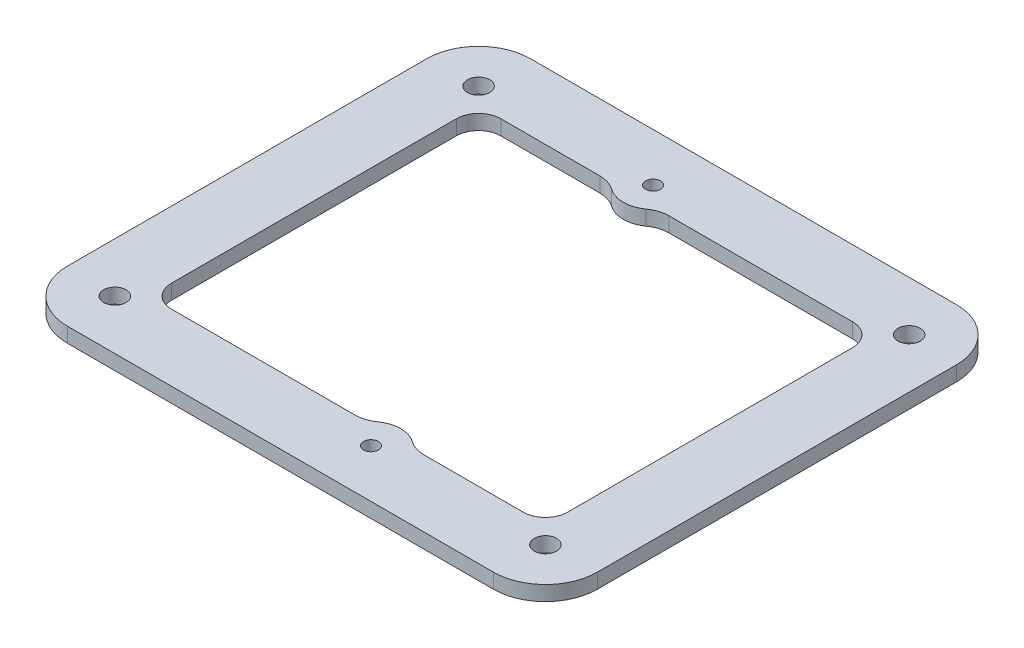
ISO-10303-21;
HEADER;
FILE_DESCRIPTION(('STEP AP214'),'2;1');
FILE_NAME('part.step','',(''),(''),'','','');
FILE_SCHEMA(('AUTOMOTIVE_DESIGN { 1 0 10303 214 1 1 1 1 }'));
ENDSEC;
DATA;
#1=APPLICATION_CONTEXT('core data for automotive mechanical design processes');
#2=APPLICATION_PROTOCOL_DEFINITION('international standard','automotive_design',2000,#1);
#3=PRODUCT_CONTEXT('',#1,'mechanical');
#4=PRODUCT('Part','Part','',(#3));
#5=PRODUCT_RELATED_PRODUCT_CATEGORY('part','',(#4));
#6=PRODUCT_DEFINITION_FORMATION('','',#4);
#7=PRODUCT_DEFINITION_CONTEXT('part definition',#1,'design');
#8=PRODUCT_DEFINITION('design','',#6,#7);
#9=PRODUCT_DEFINITION_SHAPE('','',#8);
#10=(LENGTH_UNIT() NAMED_UNIT(*) SI_UNIT(.MILLI.,.METRE.));
#11=(NAMED_UNIT(*) PLANE_ANGLE_UNIT() SI_UNIT($,.RADIAN.));
#12=(NAMED_UNIT(*) SI_UNIT($,.STERADIAN.) SOLID_ANGLE_UNIT());
#13=UNCERTAINTY_MEASURE_WITH_UNIT(LENGTH_MEASURE(1.E-05),#10,'distance_accuracy_value','');
#14=(GEOMETRIC_REPRESENTATION_CONTEXT(3) GLOBAL_UNCERTAINTY_ASSIGNED_CONTEXT((#13)) GLOBAL_UNIT_ASSIGNED_CONTEXT((#10,
#11,#12)) REPRESENTATION_CONTEXT('',''));
#15=CARTESIAN_POINT('',(0.,0.,0.));
#16=DIRECTION('',(0.,0.,1.));
#17=DIRECTION('',(1.,0.,0.));
#18=AXIS2_PLACEMENT_3D('',#15,#16,#17);
#19=CARTESIAN_POINT('',(0.,2.,0.));
#20=DIRECTION('',(0.,-1.,0.));
#21=DIRECTION('',(0.,0.,-1.));
#22=AXIS2_PLACEMENT_3D('',#19,#20,#21);
#23=PLANE('',#22);
#24=DIRECTION('',(0.,0.,-1.));
#25=VECTOR('',#24,1.);
#26=CARTESIAN_POINT('',(35.6966991411009,2.,19.1966991411009));
#27=LINE('',#26,#25);
#28=CARTESIAN_POINT('',(35.6966991411009,2.,24.1966991411009));
#29=VERTEX_POINT('',#28);
#30=CARTESIAN_POINT('',(35.6966991411009,2.,-24.1966991411009));
#31=VERTEX_POINT('',#30);
#32=EDGE_CURVE('E334',#29,#31,#27,.T.);
#33=ORIENTED_EDGE('',*,*,#32,.T.);
#34=CARTESIAN_POINT('',(28.6966991411009,2.,-24.1966991411009));
#35=DIRECTION('',(0.,-1.,0.));
#36=DIRECTION('',(0.,0.,-1.));
#37=AXIS2_PLACEMENT_3D('',#34,#35,#36);
#38=CIRCLE('',#37,7.00000000000001);
#39=CARTESIAN_POINT('',(28.6966991411009,2.,-31.1966991411008));
#40=VERTEX_POINT('',#39);
#41=EDGE_CURVE('E369',#31,#40,#38,.F.);
#42=ORIENTED_EDGE('',*,*,#41,.T.);
#43=DIRECTION('',(-1.,0.,0.));
#44=VECTOR('',#43,1.);
#45=CARTESIAN_POINT('',(-23.6966991411009,2.,-31.1966991411009));
#46=LINE('',#45,#44);
#47=CARTESIAN_POINT('',(-28.6966991411009,2.,-31.1966991411009));
#48=VERTEX_POINT('',#47);
#49=EDGE_CURVE('E326',#40,#48,#46,.T.);
#50=ORIENTED_EDGE('',*,*,#49,.T.);
#51=CARTESIAN_POINT('',(-28.6966991411009,2.,-24.1966991411009));
#52=DIRECTION('',(0.,-1.,0.));
#53=DIRECTION('',(0.,0.,-1.));
#54=AXIS2_PLACEMENT_3D('',#51,#52,#53);
#55=CIRCLE('',#54,7.00000000000001);
#56=CARTESIAN_POINT('',(-35.6966991411009,2.,-24.1966991411009));
#57=VERTEX_POINT('',#56);
#58=EDGE_CURVE('E367',#48,#57,#55,.F.);
#59=ORIENTED_EDGE('',*,*,#58,.T.);
#60=DIRECTION('',(0.,0.,1.));
#61=VECTOR('',#60,1.);
#62=CARTESIAN_POINT('',(-35.6966991411009,2.,-19.1966991411009));
#63=LINE('',#62,#61);
#64=CARTESIAN_POINT('',(-35.6966991411009,2.,24.1966991411009));
#65=VERTEX_POINT('',#64);
#66=EDGE_CURVE('E329',#57,#65,#63,.T.);
#67=ORIENTED_EDGE('',*,*,#66,.T.);
#68=CARTESIAN_POINT('',(-28.6966991411009,2.,24.1966991411009));
#69=DIRECTION('',(0.,-1.,0.));
#70=DIRECTION('',(0.,0.,-1.));
#71=AXIS2_PLACEMENT_3D('',#68,#69,#70);
#72=CIRCLE('',#71,7.00000000000001);
#73=CARTESIAN_POINT('',(-28.6966991411009,2.,31.1966991411009));
#74=VERTEX_POINT('',#73);
#75=EDGE_CURVE('E55',#65,#74,#72,.F.);
#76=ORIENTED_EDGE('',*,*,#75,.T.);
#77=DIRECTION('',(1.,0.,0.));
#78=VECTOR('',#77,1.);
#79=CARTESIAN_POINT('',(-23.6966991411009,2.,31.1966991411009));
#80=LINE('',#79,#78);
#81=CARTESIAN_POINT('',(28.6966991411009,2.,31.1966991411009));
#82=VERTEX_POINT('',#81);
#83=EDGE_CURVE('E332',#74,#82,#80,.T.);
#84=ORIENTED_EDGE('',*,*,#83,.T.);
#85=CARTESIAN_POINT('',(28.6966991411009,2.,24.1966991411009));
#86=DIRECTION('',(0.,-1.,0.));
#87=DIRECTION('',(0.,0.,-1.));
#88=AXIS2_PLACEMENT_3D('',#85,#86,#87);
#89=CIRCLE('',#88,7.00000000000001);
#90=EDGE_CURVE('E365',#82,#29,#89,.F.);
#91=ORIENTED_EDGE('',*,*,#90,.T.);
#92=EDGE_LOOP('',(#33,#42,#50,#59,#67,#76,#84,#91));
#93=FACE_BOUND('',#92,.T.);
#94=CARTESIAN_POINT('',(-10.3590840043945,2.,-18.1966991411009));
#95=DIRECTION('',(0.,1.,0.));
#96=DIRECTION('',(0.,0.,1.));
#97=AXIS2_PLACEMENT_3D('',#94,#95,#96);
#98=CIRCLE('',#97,4.);
#99=CARTESIAN_POINT('',(-8.02954142675119,2.,-21.4483497033457));
#100=VERTEX_POINT('',#99);
#101=CARTESIAN_POINT('',(-10.3590840043945,2.,-22.1966991411009));
#102=VERTEX_POINT('',#101);
#103=EDGE_CURVE('E197',#100,#102,#98,.T.);
#104=ORIENTED_EDGE('',*,*,#103,.F.);
#105=CARTESIAN_POINT('',(-5.69999884910784,2.,-24.7000002655905));
#106=DIRECTION('',(0.,-1.,0.));
#107=DIRECTION('',(0.,0.,1.));
#108=AXIS2_PLACEMENT_3D('',#105,#106,#107);
#109=CIRCLE('',#108,4.);
#110=CARTESIAN_POINT('',(-3.3704562714645,2.,-21.4483497033457));
#111=VERTEX_POINT('',#110);
#112=EDGE_CURVE('E251',#111,#100,#109,.T.);
#113=ORIENTED_EDGE('',*,*,#112,.F.);
#114=CARTESIAN_POINT('',(-1.04091369382115,2.,-18.1966991411009));
#115=DIRECTION('',(0.,1.,0.));
#116=DIRECTION('',(0.,0.,-1.));
#117=AXIS2_PLACEMENT_3D('',#114,#115,#116);
#118=CIRCLE('',#117,4.);
#119=CARTESIAN_POINT('',(-1.04091369382115,2.,-22.1966991411009));
#120=VERTEX_POINT('',#119);
#121=EDGE_CURVE('E248',#120,#111,#118,.T.);
#122=ORIENTED_EDGE('',*,*,#121,.F.);
#123=DIRECTION('',(-1.,0.,0.));
#124=VECTOR('',#123,1.);
#125=CARTESIAN_POINT('',(-1.04091369382115,2.,-22.1966991411009));
#126=LINE('',#125,#124);
#127=CARTESIAN_POINT('',(23.6966991411009,2.,-22.1966991411009));
#128=VERTEX_POINT('',#127);
#129=EDGE_CURVE('E246',#128,#120,#126,.T.);
#130=ORIENTED_EDGE('',*,*,#129,.F.);
#131=CARTESIAN_POINT('',(23.6966991411009,2.,-19.1966991411009));
#132=DIRECTION('',(0.,1.,0.));
#133=DIRECTION('',(0.,0.,1.));
#134=AXIS2_PLACEMENT_3D('',#131,#132,#133);
#135=CIRCLE('',#134,3.);
#136=CARTESIAN_POINT('',(26.6966991411009,2.,-19.1966991411009));
#137=VERTEX_POINT('',#136);
#138=EDGE_CURVE('E244',#137,#128,#135,.T.);
#139=ORIENTED_EDGE('',*,*,#138,.F.);
#140=DIRECTION('',(0.,0.,-1.));
#141=VECTOR('',#140,1.);
#142=CARTESIAN_POINT('',(26.6966991411009,2.,-19.1966991411009));
#143=LINE('',#142,#141);
#144=CARTESIAN_POINT('',(26.6966991411009,2.,19.1966991411009));
#145=VERTEX_POINT('',#144);
#146=EDGE_CURVE('E242',#145,#137,#143,.T.);
#147=ORIENTED_EDGE('',*,*,#146,.F.);
#148=CARTESIAN_POINT('',(23.6966991411009,2.,19.1966991411009));
#149=DIRECTION('',(0.,1.,0.));
#150=DIRECTION('',(0.,0.,1.));
#151=AXIS2_PLACEMENT_3D('',#148,#149,#150);
#152=CIRCLE('',#151,3.);
#153=CARTESIAN_POINT('',(23.6966991411009,2.,22.1966991411009));
#154=VERTEX_POINT('',#153);
#155=EDGE_CURVE('E240',#154,#145,#152,.T.);
#156=ORIENTED_EDGE('',*,*,#155,.F.);
#157=DIRECTION('',(1.,0.,0.));
#158=VECTOR('',#157,1.);
#159=CARTESIAN_POINT('',(10.3590870476182,2.,22.1966991411009));
#160=LINE('',#159,#158);
#161=CARTESIAN_POINT('',(10.3590870476182,2.,22.1966991411009));
#162=VERTEX_POINT('',#161);
#163=EDGE_CURVE('E238',#162,#154,#160,.T.);
#164=ORIENTED_EDGE('',*,*,#163,.F.);
#165=CARTESIAN_POINT('',(10.3590870476182,2.,18.1966991411009));
#166=DIRECTION('',(0.,1.,0.));
#167=DIRECTION('',(0.,0.,1.));
#168=AXIS2_PLACEMENT_3D('',#165,#166,#167);
#169=CIRCLE('',#168,4.);
#170=CARTESIAN_POINT('',(8.02954409925518,2.,21.4483494377552));
#171=VERTEX_POINT('',#170);
#172=EDGE_CURVE('E236',#171,#162,#169,.T.);
#173=ORIENTED_EDGE('',*,*,#172,.F.);
#174=CARTESIAN_POINT('',(5.70000115089217,2.,24.6999997344096));
#175=DIRECTION('',(0.,-1.,0.));
#176=DIRECTION('',(0.,0.,-1.));
#177=AXIS2_PLACEMENT_3D('',#174,#175,#176);
#178=CIRCLE('',#177,4.);
#179=CARTESIAN_POINT('',(3.37045820252917,2.,21.4483494377552));
#180=VERTEX_POINT('',#179);
#181=EDGE_CURVE('E234',#180,#171,#178,.T.);
#182=ORIENTED_EDGE('',*,*,#181,.F.);
#183=CARTESIAN_POINT('',(1.04091525416616,2.,18.1966991411009));
#184=DIRECTION('',(0.,1.,0.));
#185=DIRECTION('',(0.,0.,-1.));
#186=AXIS2_PLACEMENT_3D('',#183,#184,#185);
#187=CIRCLE('',#186,4.);
#188=CARTESIAN_POINT('',(1.04091525416616,2.,22.1966991411009));
#189=VERTEX_POINT('',#188);
#190=EDGE_CURVE('E232',#189,#180,#187,.T.);
#191=ORIENTED_EDGE('',*,*,#190,.F.);
#192=DIRECTION('',(1.,0.,0.));
#193=VECTOR('',#192,1.);
#194=CARTESIAN_POINT('',(-23.6966991411009,2.,22.1966991411009));
#195=LINE('',#194,#193);
#196=CARTESIAN_POINT('',(-23.6966991411009,2.,22.1966991411009));
#197=VERTEX_POINT('',#196);
#198=EDGE_CURVE('E230',#197,#189,#195,.T.);
#199=ORIENTED_EDGE('',*,*,#198,.F.);
#200=CARTESIAN_POINT('',(-23.6966991411009,2.,19.1966991411009));
#201=DIRECTION('',(0.,1.,0.));
#202=DIRECTION('',(0.,0.,1.));
#203=AXIS2_PLACEMENT_3D('',#200,#201,#202);
#204=CIRCLE('',#203,3.);
#205=CARTESIAN_POINT('',(-26.6966991411009,2.,19.1966991411009));
#206=VERTEX_POINT('',#205);
#207=EDGE_CURVE('E228',#206,#197,#204,.T.);
#208=ORIENTED_EDGE('',*,*,#207,.F.);
#209=DIRECTION('',(0.,0.,1.));
#210=VECTOR('',#209,1.);
#211=CARTESIAN_POINT('',(-26.6966991411009,2.,-19.1966991411009));
#212=LINE('',#211,#210);
#213=CARTESIAN_POINT('',(-26.6966991411009,2.,-19.1966991411009));
#214=VERTEX_POINT('',#213);
#215=EDGE_CURVE('E223',#214,#206,#212,.T.);
#216=ORIENTED_EDGE('',*,*,#215,.F.);
#217=CARTESIAN_POINT('',(-23.6966991411009,2.,-19.1966991411009));
#218=DIRECTION('',(0.,1.,0.));
#219=DIRECTION('',(0.,0.,1.));
#220=AXIS2_PLACEMENT_3D('',#217,#218,#219);
#221=CIRCLE('',#220,3.);
#222=CARTESIAN_POINT('',(-23.6966991411009,2.,-22.1966991411009));
#223=VERTEX_POINT('',#222);
#224=EDGE_CURVE('E221',#223,#214,#221,.T.);
#225=ORIENTED_EDGE('',*,*,#224,.F.);
#226=DIRECTION('',(-1.,0.,0.));
#227=VECTOR('',#226,1.);
#228=CARTESIAN_POINT('',(-23.6966991411009,2.,-22.1966991411009));
#229=LINE('',#228,#227);
#230=EDGE_CURVE('E207',#102,#223,#229,.T.);
#231=ORIENTED_EDGE('',*,*,#230,.F.);
#232=EDGE_LOOP('',(#104,#113,#122,#130,#139,#147,#156,#164,#173,#182,#191,#199,#208,#216,#225,#231));
#233=FACE_BOUND('',#232,.T.);
#234=CARTESIAN_POINT('',(-29.,2.,-24.5));
#235=DIRECTION('',(0.,1.,0.));
#236=DIRECTION('',(0.,0.,-1.));
#237=AXIS2_PLACEMENT_3D('',#234,#235,#236);
#238=CIRCLE('',#237,1.5);
#239=CARTESIAN_POINT('',(-29.,2.,-26.));
#240=VERTEX_POINT('',#239);
#241=EDGE_CURVE('E255',#240,#240,#238,.T.);
#242=ORIENTED_EDGE('',*,*,#241,.F.);
#243=EDGE_LOOP('',(#242));
#244=FACE_BOUND('',#243,.T.);
#245=CARTESIAN_POINT('',(29.,2.,24.5));
#246=DIRECTION('',(0.,1.,0.));
#247=DIRECTION('',(0.,0.,-1.));
#248=AXIS2_PLACEMENT_3D('',#245,#246,#247);
#249=CIRCLE('',#248,1.5);
#250=CARTESIAN_POINT('',(29.,2.,23.));
#251=VERTEX_POINT('',#250);
#252=EDGE_CURVE('E800',#251,#251,#249,.T.);
#253=ORIENTED_EDGE('',*,*,#252,.F.);
#254=EDGE_LOOP('',(#253));
#255=FACE_BOUND('',#254,.T.);
#256=CARTESIAN_POINT('',(29.,2.,-24.5));
#257=DIRECTION('',(0.,1.,0.));
#258=DIRECTION('',(0.,0.,1.));
#259=AXIS2_PLACEMENT_3D('',#256,#257,#258);
#260=CIRCLE('',#259,1.5);
#261=CARTESIAN_POINT('',(29.,2.,-23.));
#262=VERTEX_POINT('',#261);
#263=EDGE_CURVE('E795',#262,#262,#260,.T.);
#264=ORIENTED_EDGE('',*,*,#263,.F.);
#265=EDGE_LOOP('',(#264));
#266=FACE_BOUND('',#265,.T.);
#267=CARTESIAN_POINT('',(-29.,2.,24.5));
#268=DIRECTION('',(0.,1.,0.));
#269=DIRECTION('',(0.,0.,1.));
#270=AXIS2_PLACEMENT_3D('',#267,#268,#269);
#271=CIRCLE('',#270,1.5);
#272=CARTESIAN_POINT('',(-29.,2.,26.));
#273=VERTEX_POINT('',#272);
#274=EDGE_CURVE('E790',#273,#273,#271,.T.);
#275=ORIENTED_EDGE('',*,*,#274,.F.);
#276=EDGE_LOOP('',(#275));
#277=FACE_BOUND('',#276,.T.);
#278=CARTESIAN_POINT('',(-5.69999884910784,2.,-24.7000002655905));
#279=DIRECTION('',(0.,1.,0.));
#280=DIRECTION('',(0.,0.,1.));
#281=AXIS2_PLACEMENT_3D('',#278,#279,#280);
#282=CIRCLE('',#281,1.00000000000001);
#283=CARTESIAN_POINT('',(-5.69999884910784,2.,-23.7000002655904));
#284=VERTEX_POINT('',#283);
#285=EDGE_CURVE('E785',#284,#284,#282,.T.);
#286=ORIENTED_EDGE('',*,*,#285,.F.);
#287=EDGE_LOOP('',(#286));
#288=FACE_BOUND('',#287,.T.);
#289=CARTESIAN_POINT('',(5.70000115089217,2.,24.6999997344096));
#290=DIRECTION('',(0.,1.,0.));
#291=DIRECTION('',(0.,0.,1.));
#292=AXIS2_PLACEMENT_3D('',#289,#290,#291);
#293=CIRCLE('',#292,1.00000000000001);
#294=CARTESIAN_POINT('',(5.70000115089217,2.,25.6999997344096));
#295=VERTEX_POINT('',#294);
#296=EDGE_CURVE('E779',#295,#295,#293,.T.);
#297=ORIENTED_EDGE('',*,*,#296,.F.);
#298=EDGE_LOOP('',(#297));
#299=FACE_BOUND('',#298,.T.);
#300=ADVANCED_FACE('F35',(#93,#233,#244,#255,#266,#277,#288,#299),#23,.F.);
#301=CARTESIAN_POINT('',(0.,0.,0.));
#302=DIRECTION('',(0.,-1.,0.));
#303=DIRECTION('',(0.,0.,-1.));
#304=AXIS2_PLACEMENT_3D('',#301,#302,#303);
#305=PLANE('',#304);
#306=CARTESIAN_POINT('',(-5.69999884910784,0.,-24.7000002655905));
#307=DIRECTION('',(0.,1.,0.));
#308=DIRECTION('',(0.,0.,1.));
#309=AXIS2_PLACEMENT_3D('',#306,#307,#308);
#310=CIRCLE('',#309,1.00000000000001);
#311=CARTESIAN_POINT('',(-5.69999884910784,0.,-23.7000002655904));
#312=VERTEX_POINT('',#311);
#313=EDGE_CURVE('E782',#312,#312,#310,.T.);
#314=ORIENTED_EDGE('',*,*,#313,.T.);
#315=EDGE_LOOP('',(#314));
#316=FACE_BOUND('',#315,.T.);
#317=CARTESIAN_POINT('',(29.,0.,-24.5));
#318=DIRECTION('',(0.,1.,0.));
#319=DIRECTION('',(0.,0.,1.));
#320=AXIS2_PLACEMENT_3D('',#317,#318,#319);
#321=CIRCLE('',#320,1.5);
#322=CARTESIAN_POINT('',(29.,0.,-23.));
#323=VERTEX_POINT('',#322);
#324=EDGE_CURVE('E793',#323,#323,#321,.T.);
#325=ORIENTED_EDGE('',*,*,#324,.T.);
#326=EDGE_LOOP('',(#325));
#327=FACE_BOUND('',#326,.T.);
#328=CARTESIAN_POINT('',(-29.,0.,-24.5));
#329=DIRECTION('',(0.,1.,0.));
#330=DIRECTION('',(0.,0.,-1.));
#331=AXIS2_PLACEMENT_3D('',#328,#329,#330);
#332=CIRCLE('',#331,1.5);
#333=CARTESIAN_POINT('',(-29.,0.,-26.));
#334=VERTEX_POINT('',#333);
#335=EDGE_CURVE('E803',#334,#334,#332,.T.);
#336=ORIENTED_EDGE('',*,*,#335,.T.);
#337=EDGE_LOOP('',(#336));
#338=FACE_BOUND('',#337,.T.);
#339=DIRECTION('',(-1.,0.,0.));
#340=VECTOR('',#339,1.);
#341=CARTESIAN_POINT('',(-23.6966991411009,0.,-31.1966991411009));
#342=LINE('',#341,#340);
#343=CARTESIAN_POINT('',(28.6966991411009,0.,-31.1966991411009));
#344=VERTEX_POINT('',#343);
#345=CARTESIAN_POINT('',(-28.6966991411009,0.,-31.1966991411009));
#346=VERTEX_POINT('',#345);
#347=EDGE_CURVE('E330',#344,#346,#342,.T.);
#348=ORIENTED_EDGE('',*,*,#347,.F.);
#349=CARTESIAN_POINT('',(28.6966991411009,0.,-24.1966991411009));
#350=DIRECTION('',(0.,-1.,0.));
#351=DIRECTION('',(0.,0.,-1.));
#352=AXIS2_PLACEMENT_3D('',#349,#350,#351);
#353=CIRCLE('',#352,7.00000000000001);
#354=CARTESIAN_POINT('',(35.6966991411009,0.,-24.1966991411009));
#355=VERTEX_POINT('',#354);
#356=EDGE_CURVE('E357',#344,#355,#353,.T.);
#357=ORIENTED_EDGE('',*,*,#356,.T.);
#358=DIRECTION('',(0.,0.,-1.));
#359=VECTOR('',#358,1.);
#360=CARTESIAN_POINT('',(35.6966991411009,0.,-19.1966991411009));
#361=LINE('',#360,#359);
#362=CARTESIAN_POINT('',(35.6966991411009,0.,24.1966991411009));
#363=VERTEX_POINT('',#362);
#364=EDGE_CURVE('E342',#363,#355,#361,.T.);
#365=ORIENTED_EDGE('',*,*,#364,.F.);
#366=CARTESIAN_POINT('',(28.6966991411009,0.,24.1966991411009));
#367=DIRECTION('',(0.,-1.,0.));
#368=DIRECTION('',(0.,0.,-1.));
#369=AXIS2_PLACEMENT_3D('',#366,#367,#368);
#370=CIRCLE('',#369,7.00000000000001);
#371=CARTESIAN_POINT('',(28.6966991411009,0.,31.1966991411009));
#372=VERTEX_POINT('',#371);
#373=EDGE_CURVE('E353',#363,#372,#370,.T.);
#374=ORIENTED_EDGE('',*,*,#373,.T.);
#375=DIRECTION('',(1.,0.,0.));
#376=VECTOR('',#375,1.);
#377=CARTESIAN_POINT('',(23.6966991411009,0.,31.1966991411009));
#378=LINE('',#377,#376);
#379=CARTESIAN_POINT('',(-28.6966991411009,0.,31.1966991411009));
#380=VERTEX_POINT('',#379);
#381=EDGE_CURVE('E340',#380,#372,#378,.T.);
#382=ORIENTED_EDGE('',*,*,#381,.F.);
#383=CARTESIAN_POINT('',(-28.6966991411009,0.,24.1966991411009));
#384=DIRECTION('',(0.,-1.,0.));
#385=DIRECTION('',(0.,0.,-1.));
#386=AXIS2_PLACEMENT_3D('',#383,#384,#385);
#387=CIRCLE('',#386,7.00000000000001);
#388=CARTESIAN_POINT('',(-35.6966991411009,0.,24.1966991411009));
#389=VERTEX_POINT('',#388);
#390=EDGE_CURVE('E351',#380,#389,#387,.T.);
#391=ORIENTED_EDGE('',*,*,#390,.T.);
#392=DIRECTION('',(0.,0.,1.));
#393=VECTOR('',#392,1.);
#394=CARTESIAN_POINT('',(-35.6966991411009,0.,19.1966991411009));
#395=LINE('',#394,#393);
#396=CARTESIAN_POINT('',(-35.6966991411009,0.,-24.1966991411009));
#397=VERTEX_POINT('',#396);
#398=EDGE_CURVE('E215',#397,#389,#395,.T.);
#399=ORIENTED_EDGE('',*,*,#398,.F.);
#400=CARTESIAN_POINT('',(-28.6966991411009,0.,-24.1966991411009));
#401=DIRECTION('',(0.,-1.,0.));
#402=DIRECTION('',(0.,0.,-1.));
#403=AXIS2_PLACEMENT_3D('',#400,#401,#402);
#404=CIRCLE('',#403,7.00000000000001);
#405=EDGE_CURVE('E355',#397,#346,#404,.T.);
#406=ORIENTED_EDGE('',*,*,#405,.T.);
#407=EDGE_LOOP('',(#348,#357,#365,#374,#382,#391,#399,#406));
#408=FACE_BOUND('',#407,.T.);
#409=CARTESIAN_POINT('',(-5.69999884910784,0.,-24.7000002655905));
#410=DIRECTION('',(0.,-1.,0.));
#411=DIRECTION('',(0.,0.,1.));
#412=AXIS2_PLACEMENT_3D('',#409,#410,#411);
#413=CIRCLE('',#412,4.);
#414=CARTESIAN_POINT('',(-3.3704562714645,0.,-21.4483497033457));
#415=VERTEX_POINT('',#414);
#416=CARTESIAN_POINT('',(-8.02954142675119,0.,-21.4483497033457));
#417=VERTEX_POINT('',#416);
#418=EDGE_CURVE('E208',#415,#417,#413,.T.);
#419=ORIENTED_EDGE('',*,*,#418,.T.);
#420=CARTESIAN_POINT('',(-10.3590840043945,0.,-18.1966991411009));
#421=DIRECTION('',(0.,1.,0.));
#422=DIRECTION('',(0.,0.,1.));
#423=AXIS2_PLACEMENT_3D('',#420,#421,#422);
#424=CIRCLE('',#423,4.);
#425=CARTESIAN_POINT('',(-10.3590840043945,0.,-22.1966991411009));
#426=VERTEX_POINT('',#425);
#427=EDGE_CURVE('E253',#417,#426,#424,.T.);
#428=ORIENTED_EDGE('',*,*,#427,.T.);
#429=DIRECTION('',(-1.,0.,0.));
#430=VECTOR('',#429,1.);
#431=CARTESIAN_POINT('',(-23.6966991411009,0.,-22.1966991411009));
#432=LINE('',#431,#430);
#433=CARTESIAN_POINT('',(-23.6966991411009,0.,-22.1966991411009));
#434=VERTEX_POINT('',#433);
#435=EDGE_CURVE('E214',#426,#434,#432,.T.);
#436=ORIENTED_EDGE('',*,*,#435,.T.);
#437=CARTESIAN_POINT('',(-23.6966991411009,0.,-19.1966991411009));
#438=DIRECTION('',(0.,1.,0.));
#439=DIRECTION('',(0.,0.,1.));
#440=AXIS2_PLACEMENT_3D('',#437,#438,#439);
#441=CIRCLE('',#440,3.);
#442=CARTESIAN_POINT('',(-26.6966991411009,0.,-19.1966991411009));
#443=VERTEX_POINT('',#442);
#444=EDGE_CURVE('E257',#434,#443,#441,.T.);
#445=ORIENTED_EDGE('',*,*,#444,.T.);
#446=DIRECTION('',(0.,0.,1.));
#447=VECTOR('',#446,1.);
#448=CARTESIAN_POINT('',(-26.6966991411009,0.,-19.1966991411009));
#449=LINE('',#448,#447);
#450=CARTESIAN_POINT('',(-26.6966991411009,0.,19.1966991411009));
#451=VERTEX_POINT('',#450);
#452=EDGE_CURVE('E260',#443,#451,#449,.T.);
#453=ORIENTED_EDGE('',*,*,#452,.T.);
#454=CARTESIAN_POINT('',(-23.6966991411009,0.,19.1966991411009));
#455=DIRECTION('',(0.,1.,0.));
#456=DIRECTION('',(0.,0.,1.));
#457=AXIS2_PLACEMENT_3D('',#454,#455,#456);
#458=CIRCLE('',#457,3.);
#459=CARTESIAN_POINT('',(-23.6966991411009,0.,22.1966991411009));
#460=VERTEX_POINT('',#459);
#461=EDGE_CURVE('E263',#451,#460,#458,.T.);
#462=ORIENTED_EDGE('',*,*,#461,.T.);
#463=DIRECTION('',(1.,0.,0.));
#464=VECTOR('',#463,1.);
#465=CARTESIAN_POINT('',(-23.6966991411009,0.,22.1966991411009));
#466=LINE('',#465,#464);
#467=CARTESIAN_POINT('',(1.04091525416616,0.,22.1966991411009));
#468=VERTEX_POINT('',#467);
#469=EDGE_CURVE('E266',#460,#468,#466,.T.);
#470=ORIENTED_EDGE('',*,*,#469,.T.);
#471=CARTESIAN_POINT('',(1.04091525416616,0.,18.1966991411009));
#472=DIRECTION('',(0.,1.,0.));
#473=DIRECTION('',(0.,0.,-1.));
#474=AXIS2_PLACEMENT_3D('',#471,#472,#473);
#475=CIRCLE('',#474,4.);
#476=CARTESIAN_POINT('',(3.37045820252917,0.,21.4483494377552));
#477=VERTEX_POINT('',#476);
#478=EDGE_CURVE('E269',#468,#477,#475,.T.);
#479=ORIENTED_EDGE('',*,*,#478,.T.);
#480=CARTESIAN_POINT('',(5.70000115089217,0.,24.6999997344096));
#481=DIRECTION('',(0.,-1.,0.));
#482=DIRECTION('',(0.,0.,-1.));
#483=AXIS2_PLACEMENT_3D('',#480,#481,#482);
#484=CIRCLE('',#483,4.);
#485=CARTESIAN_POINT('',(8.02954409925518,0.,21.4483494377552));
#486=VERTEX_POINT('',#485);
#487=EDGE_CURVE('E272',#477,#486,#484,.T.);
#488=ORIENTED_EDGE('',*,*,#487,.T.);
#489=CARTESIAN_POINT('',(10.3590870476182,0.,18.1966991411009));
#490=DIRECTION('',(0.,1.,0.));
#491=DIRECTION('',(0.,0.,1.));
#492=AXIS2_PLACEMENT_3D('',#489,#490,#491);
#493=CIRCLE('',#492,4.);
#494=CARTESIAN_POINT('',(10.3590870476182,0.,22.1966991411009));
#495=VERTEX_POINT('',#494);
#496=EDGE_CURVE('E275',#486,#495,#493,.T.);
#497=ORIENTED_EDGE('',*,*,#496,.T.);
#498=DIRECTION('',(1.,0.,0.));
#499=VECTOR('',#498,1.);
#500=CARTESIAN_POINT('',(10.3590870476182,0.,22.1966991411009));
#501=LINE('',#500,#499);
#502=CARTESIAN_POINT('',(23.6966991411009,0.,22.1966991411009));
#503=VERTEX_POINT('',#502);
#504=EDGE_CURVE('E278',#495,#503,#501,.T.);
#505=ORIENTED_EDGE('',*,*,#504,.T.);
#506=CARTESIAN_POINT('',(23.6966991411009,0.,19.1966991411009));
#507=DIRECTION('',(0.,1.,0.));
#508=DIRECTION('',(0.,0.,1.));
#509=AXIS2_PLACEMENT_3D('',#506,#507,#508);
#510=CIRCLE('',#509,3.);
#511=CARTESIAN_POINT('',(26.6966991411009,0.,19.1966991411009));
#512=VERTEX_POINT('',#511);
#513=EDGE_CURVE('E281',#503,#512,#510,.T.);
#514=ORIENTED_EDGE('',*,*,#513,.T.);
#515=DIRECTION('',(0.,0.,-1.));
#516=VECTOR('',#515,1.);
#517=CARTESIAN_POINT('',(26.6966991411009,0.,-19.1966991411009));
#518=LINE('',#517,#516);
#519=CARTESIAN_POINT('',(26.6966991411009,0.,-19.1966991411009));
#520=VERTEX_POINT('',#519);
#521=EDGE_CURVE('E284',#512,#520,#518,.T.);
#522=ORIENTED_EDGE('',*,*,#521,.T.);
#523=CARTESIAN_POINT('',(23.6966991411009,0.,-19.1966991411009));
#524=DIRECTION('',(0.,1.,0.));
#525=DIRECTION('',(0.,0.,1.));
#526=AXIS2_PLACEMENT_3D('',#523,#524,#525);
#527=CIRCLE('',#526,3.);
#528=CARTESIAN_POINT('',(23.6966991411009,0.,-22.1966991411009));
#529=VERTEX_POINT('',#528);
#530=EDGE_CURVE('E287',#520,#529,#527,.T.);
#531=ORIENTED_EDGE('',*,*,#530,.T.);
#532=DIRECTION('',(-1.,0.,0.));
#533=VECTOR('',#532,1.);
#534=CARTESIAN_POINT('',(-1.04091369382115,0.,-22.1966991411009));
#535=LINE('',#534,#533);
#536=CARTESIAN_POINT('',(-1.04091369382115,0.,-22.1966991411009));
#537=VERTEX_POINT('',#536);
#538=EDGE_CURVE('E290',#529,#537,#535,.T.);
#539=ORIENTED_EDGE('',*,*,#538,.T.);
#540=CARTESIAN_POINT('',(-1.04091369382115,0.,-18.1966991411009));
#541=DIRECTION('',(0.,1.,0.));
#542=DIRECTION('',(0.,0.,-1.));
#543=AXIS2_PLACEMENT_3D('',#540,#541,#542);
#544=CIRCLE('',#543,4.);
#545=EDGE_CURVE('E293',#537,#415,#544,.T.);
#546=ORIENTED_EDGE('',*,*,#545,.T.);
#547=EDGE_LOOP('',(#419,#428,#436,#445,#453,#462,#470,#479,#488,#497,#505,#514,#522,#531,#539,#546));
#548=FACE_BOUND('',#547,.T.);
#549=CARTESIAN_POINT('',(29.,0.,24.5));
#550=DIRECTION('',(0.,1.,0.));
#551=DIRECTION('',(0.,0.,-1.));
#552=AXIS2_PLACEMENT_3D('',#549,#550,#551);
#553=CIRCLE('',#552,1.5);
#554=CARTESIAN_POINT('',(29.,0.,23.));
#555=VERTEX_POINT('',#554);
#556=EDGE_CURVE('E770',#555,#555,#553,.T.);
#557=ORIENTED_EDGE('',*,*,#556,.T.);
#558=EDGE_LOOP('',(#557));
#559=FACE_BOUND('',#558,.T.);
#560=CARTESIAN_POINT('',(-29.,0.,24.5));
#561=DIRECTION('',(0.,1.,0.));
#562=DIRECTION('',(0.,0.,1.));
#563=AXIS2_PLACEMENT_3D('',#560,#561,#562);
#564=CIRCLE('',#563,1.5);
#565=CARTESIAN_POINT('',(-29.,0.,26.));
#566=VERTEX_POINT('',#565);
#567=EDGE_CURVE('E774',#566,#566,#564,.T.);
#568=ORIENTED_EDGE('',*,*,#567,.T.);
#569=EDGE_LOOP('',(#568));
#570=FACE_BOUND('',#569,.T.);
#571=CARTESIAN_POINT('',(5.70000115089217,0.,24.6999997344096));
#572=DIRECTION('',(0.,1.,0.));
#573=DIRECTION('',(0.,0.,1.));
#574=AXIS2_PLACEMENT_3D('',#571,#572,#573);
#575=CIRCLE('',#574,1.00000000000001);
#576=CARTESIAN_POINT('',(5.70000115089217,0.,25.6999997344096));
#577=VERTEX_POINT('',#576);
#578=EDGE_CURVE('E777',#577,#577,#575,.T.);
#579=ORIENTED_EDGE('',*,*,#578,.T.);
#580=EDGE_LOOP('',(#579));
#581=FACE_BOUND('',#580,.T.);
#582=ADVANCED_FACE('F382',(#316,#327,#338,#408,#548,#559,#570,#581),#305,.T.);
#583=CARTESIAN_POINT('',(-35.6966991411009,2.,19.1966991411009));
#584=DIRECTION('',(1.,0.,0.));
#585=DIRECTION('',(0.,0.,-1.));
#586=AXIS2_PLACEMENT_3D('',#583,#584,#585);
#587=PLANE('',#586);
#588=ORIENTED_EDGE('',*,*,#66,.F.);
#589=DIRECTION('',(0.,-1.,0.));
#590=VECTOR('',#589,1.);
#591=CARTESIAN_POINT('',(-35.6966991411009,2.,-24.1966991411009));
#592=LINE('',#591,#590);
#593=EDGE_CURVE('E373',#57,#397,#592,.T.);
#594=ORIENTED_EDGE('',*,*,#593,.T.);
#595=ORIENTED_EDGE('',*,*,#398,.T.);
#596=DIRECTION('',(0.,-1.,0.));
#597=VECTOR('',#596,1.);
#598=CARTESIAN_POINT('',(-35.6966991411009,2.,24.1966991411009));
#599=LINE('',#598,#597);
#600=EDGE_CURVE('E371',#389,#65,#599,.F.);
#601=ORIENTED_EDGE('',*,*,#600,.T.);
#602=EDGE_LOOP('',(#588,#594,#595,#601));
#603=FACE_BOUND('',#602,.T.);
#604=ADVANCED_FACE('F408',(#603),#587,.F.);
#605=CARTESIAN_POINT('',(23.6966991411009,2.,31.1966991411009));
#606=DIRECTION('',(0.,0.,-1.));
#607=DIRECTION('',(-1.,0.,0.));
#608=AXIS2_PLACEMENT_3D('',#605,#606,#607);
#609=PLANE('',#608);
#610=ORIENTED_EDGE('',*,*,#381,.T.);
#611=DIRECTION('',(0.,-1.,0.));
#612=VECTOR('',#611,1.);
#613=CARTESIAN_POINT('',(28.6966991411009,2.,31.1966991411009));
#614=LINE('',#613,#612);
#615=EDGE_CURVE('E11',#372,#82,#614,.F.);
#616=ORIENTED_EDGE('',*,*,#615,.T.);
#617=ORIENTED_EDGE('',*,*,#83,.F.);
#618=DIRECTION('',(0.,-1.,0.));
#619=VECTOR('',#618,1.);
#620=CARTESIAN_POINT('',(-28.6966991411009,2.,31.1966991411009));
#621=LINE('',#620,#619);
#622=EDGE_CURVE('E43',#74,#380,#621,.T.);
#623=ORIENTED_EDGE('',*,*,#622,.T.);
#624=EDGE_LOOP('',(#610,#616,#617,#623));
#625=FACE_BOUND('',#624,.T.);
#626=ADVANCED_FACE('F378',(#625),#609,.F.);
#627=CARTESIAN_POINT('',(35.6966991411009,2.,-19.1966991411009));
#628=DIRECTION('',(-1.,0.,0.));
#629=DIRECTION('',(0.,0.,1.));
#630=AXIS2_PLACEMENT_3D('',#627,#628,#629);
#631=PLANE('',#630);
#632=ORIENTED_EDGE('',*,*,#364,.T.);
#633=DIRECTION('',(0.,-1.,0.));
#634=VECTOR('',#633,1.);
#635=CARTESIAN_POINT('',(35.6966991411009,2.,-24.1966991411009));
#636=LINE('',#635,#634);
#637=EDGE_CURVE('E362',#355,#31,#636,.F.);
#638=ORIENTED_EDGE('',*,*,#637,.T.);
#639=ORIENTED_EDGE('',*,*,#32,.F.);
#640=DIRECTION('',(0.,-1.,0.));
#641=VECTOR('',#640,1.);
#642=CARTESIAN_POINT('',(35.6966991411009,2.,24.1966991411009));
#643=LINE('',#642,#641);
#644=EDGE_CURVE('E359',#29,#363,#643,.T.);
#645=ORIENTED_EDGE('',*,*,#644,.T.);
#646=EDGE_LOOP('',(#632,#638,#639,#645));
#647=FACE_BOUND('',#646,.T.);
#648=ADVANCED_FACE('F392',(#647),#631,.F.);
#649=CARTESIAN_POINT('',(-23.6966991411009,2.,-31.1966991411009));
#650=DIRECTION('',(0.,0.,1.));
#651=DIRECTION('',(1.,0.,0.));
#652=AXIS2_PLACEMENT_3D('',#649,#650,#651);
#653=PLANE('',#652);
#654=ORIENTED_EDGE('',*,*,#49,.F.);
#655=DIRECTION('',(0.,-1.,0.));
#656=VECTOR('',#655,1.);
#657=CARTESIAN_POINT('',(28.6966991411009,2.,-31.1966991411009));
#658=LINE('',#657,#656);
#659=EDGE_CURVE('E348',#40,#344,#658,.T.);
#660=ORIENTED_EDGE('',*,*,#659,.T.);
#661=ORIENTED_EDGE('',*,*,#347,.T.);
#662=DIRECTION('',(0.,-1.,0.));
#663=VECTOR('',#662,1.);
#664=CARTESIAN_POINT('',(-28.6966991411009,2.,-31.1966991411009));
#665=LINE('',#664,#663);
#666=EDGE_CURVE('E337',#346,#48,#665,.F.);
#667=ORIENTED_EDGE('',*,*,#666,.T.);
#668=EDGE_LOOP('',(#654,#660,#661,#667));
#669=FACE_BOUND('',#668,.T.);
#670=ADVANCED_FACE('F400',(#669),#653,.F.);
#671=CARTESIAN_POINT('',(-10.3590840043945,2.,-18.1966991411009));
#672=DIRECTION('',(0.,-1.,0.));
#673=DIRECTION('',(0.,0.,-1.));
#674=AXIS2_PLACEMENT_3D('',#671,#672,#673);
#675=CYLINDRICAL_SURFACE('',#674,4.);
#676=ORIENTED_EDGE('',*,*,#427,.F.);
#677=DIRECTION('',(0.,-1.,0.));
#678=VECTOR('',#677,1.);
#679=CARTESIAN_POINT('',(-8.02954142675119,2.,-21.4483497033457));
#680=LINE('',#679,#678);
#681=EDGE_CURVE('E203',#100,#417,#680,.T.);
#682=ORIENTED_EDGE('',*,*,#681,.F.);
#683=ORIENTED_EDGE('',*,*,#103,.T.);
#684=DIRECTION('',(0.,-1.,0.));
#685=VECTOR('',#684,1.);
#686=CARTESIAN_POINT('',(-10.3590840043945,2.,-22.1966991411009));
#687=LINE('',#686,#685);
#688=EDGE_CURVE('E200',#102,#426,#687,.T.);
#689=ORIENTED_EDGE('',*,*,#688,.T.);
#690=EDGE_LOOP('',(#676,#682,#683,#689));
#691=FACE_BOUND('',#690,.T.);
#692=ADVANCED_FACE('F199',(#691),#675,.F.);
#693=CARTESIAN_POINT('',(-23.6966991411009,2.,-22.1966991411009));
#694=DIRECTION('',(0.,0.,1.));
#695=DIRECTION('',(1.,0.,0.));
#696=AXIS2_PLACEMENT_3D('',#693,#694,#695);
#697=PLANE('',#696);
#698=ORIENTED_EDGE('',*,*,#435,.F.);
#699=ORIENTED_EDGE('',*,*,#688,.F.);
#700=ORIENTED_EDGE('',*,*,#230,.T.);
#701=DIRECTION('',(0.,-1.,0.));
#702=VECTOR('',#701,1.);
#703=CARTESIAN_POINT('',(-23.6966991411009,2.,-22.1966991411009));
#704=LINE('',#703,#702);
#705=EDGE_CURVE('E216',#223,#434,#704,.T.);
#706=ORIENTED_EDGE('',*,*,#705,.T.);
#707=EDGE_LOOP('',(#698,#699,#700,#706));
#708=FACE_BOUND('',#707,.T.);
#709=ADVANCED_FACE('F211',(#708),#697,.T.);
#710=CARTESIAN_POINT('',(-23.6966991411009,2.,-19.1966991411009));
#711=DIRECTION('',(0.,-1.,0.));
#712=DIRECTION('',(0.,0.,-1.));
#713=AXIS2_PLACEMENT_3D('',#710,#711,#712);
#714=CYLINDRICAL_SURFACE('',#713,3.);
#715=ORIENTED_EDGE('',*,*,#444,.F.);
#716=ORIENTED_EDGE('',*,*,#705,.F.);
#717=ORIENTED_EDGE('',*,*,#224,.T.);
#718=DIRECTION('',(0.,-1.,0.));
#719=VECTOR('',#718,1.);
#720=CARTESIAN_POINT('',(-26.6966991411009,2.,-19.1966991411009));
#721=LINE('',#720,#719);
#722=EDGE_CURVE('E323',#214,#443,#721,.T.);
#723=ORIENTED_EDGE('',*,*,#722,.T.);
#724=EDGE_LOOP('',(#715,#716,#717,#723));
#725=FACE_BOUND('',#724,.T.);
#726=ADVANCED_FACE('F627',(#725),#714,.F.);
#727=CARTESIAN_POINT('',(-26.6966991411009,2.,-19.1966991411009));
#728=DIRECTION('',(1.,0.,0.));
#729=DIRECTION('',(0.,0.,-1.));
#730=AXIS2_PLACEMENT_3D('',#727,#728,#729);
#731=PLANE('',#730);
#732=ORIENTED_EDGE('',*,*,#452,.F.);
#733=ORIENTED_EDGE('',*,*,#722,.F.);
#734=ORIENTED_EDGE('',*,*,#215,.T.);
#735=DIRECTION('',(0.,-1.,0.));
#736=VECTOR('',#735,1.);
#737=CARTESIAN_POINT('',(-26.6966991411009,2.,19.1966991411009));
#738=LINE('',#737,#736);
#739=EDGE_CURVE('E321',#206,#451,#738,.T.);
#740=ORIENTED_EDGE('',*,*,#739,.T.);
#741=EDGE_LOOP('',(#732,#733,#734,#740));
#742=FACE_BOUND('',#741,.T.);
#743=ADVANCED_FACE('F618',(#742),#731,.T.);
#744=CARTESIAN_POINT('',(-23.6966991411009,2.,19.1966991411009));
#745=DIRECTION('',(0.,-1.,0.));
#746=DIRECTION('',(0.,0.,-1.));
#747=AXIS2_PLACEMENT_3D('',#744,#745,#746);
#748=CYLINDRICAL_SURFACE('',#747,3.);
#749=ORIENTED_EDGE('',*,*,#461,.F.);
#750=ORIENTED_EDGE('',*,*,#739,.F.);
#751=ORIENTED_EDGE('',*,*,#207,.T.);
#752=DIRECTION('',(0.,-1.,0.));
#753=VECTOR('',#752,1.);
#754=CARTESIAN_POINT('',(-23.6966991411009,2.,22.1966991411009));
#755=LINE('',#754,#753);
#756=EDGE_CURVE('E319',#197,#460,#755,.T.);
#757=ORIENTED_EDGE('',*,*,#756,.T.);
#758=EDGE_LOOP('',(#749,#750,#751,#757));
#759=FACE_BOUND('',#758,.T.);
#760=ADVANCED_FACE('F609',(#759),#748,.F.);
#761=CARTESIAN_POINT('',(-23.6966991411009,2.,22.1966991411009));
#762=DIRECTION('',(0.,0.,-1.));
#763=DIRECTION('',(-1.,0.,0.));
#764=AXIS2_PLACEMENT_3D('',#761,#762,#763);
#765=PLANE('',#764);
#766=ORIENTED_EDGE('',*,*,#469,.F.);
#767=ORIENTED_EDGE('',*,*,#756,.F.);
#768=ORIENTED_EDGE('',*,*,#198,.T.);
#769=DIRECTION('',(0.,-1.,0.));
#770=VECTOR('',#769,1.);
#771=CARTESIAN_POINT('',(1.04091525416616,2.,22.1966991411009));
#772=LINE('',#771,#770);
#773=EDGE_CURVE('E317',#189,#468,#772,.T.);
#774=ORIENTED_EDGE('',*,*,#773,.T.);
#775=EDGE_LOOP('',(#766,#767,#768,#774));
#776=FACE_BOUND('',#775,.T.);
#777=ADVANCED_FACE('F600',(#776),#765,.T.);
#778=CARTESIAN_POINT('',(1.04091525416616,2.,18.1966991411009));
#779=DIRECTION('',(0.,-1.,0.));
#780=DIRECTION('',(0.,0.,-1.));
#781=AXIS2_PLACEMENT_3D('',#778,#779,#780);
#782=CYLINDRICAL_SURFACE('',#781,4.);
#783=ORIENTED_EDGE('',*,*,#478,.F.);
#784=ORIENTED_EDGE('',*,*,#773,.F.);
#785=ORIENTED_EDGE('',*,*,#190,.T.);
#786=DIRECTION('',(0.,-1.,0.));
#787=VECTOR('',#786,1.);
#788=CARTESIAN_POINT('',(3.37045820252917,2.,21.4483494377552));
#789=LINE('',#788,#787);
#790=EDGE_CURVE('E315',#180,#477,#789,.T.);
#791=ORIENTED_EDGE('',*,*,#790,.T.);
#792=EDGE_LOOP('',(#783,#784,#785,#791));
#793=FACE_BOUND('',#792,.T.);
#794=ADVANCED_FACE('F591',(#793),#782,.F.);
#795=CARTESIAN_POINT('',(5.70000115089217,2.,24.6999997344096));
#796=DIRECTION('',(0.,-1.,0.));
#797=DIRECTION('',(0.,0.,-1.));
#798=AXIS2_PLACEMENT_3D('',#795,#796,#797);
#799=CYLINDRICAL_SURFACE('',#798,4.);
#800=ORIENTED_EDGE('',*,*,#487,.F.);
#801=ORIENTED_EDGE('',*,*,#790,.F.);
#802=ORIENTED_EDGE('',*,*,#181,.T.);
#803=DIRECTION('',(0.,-1.,0.));
#804=VECTOR('',#803,1.);
#805=CARTESIAN_POINT('',(8.02954409925518,2.,21.4483494377552));
#806=LINE('',#805,#804);
#807=EDGE_CURVE('E313',#171,#486,#806,.T.);
#808=ORIENTED_EDGE('',*,*,#807,.T.);
#809=EDGE_LOOP('',(#800,#801,#802,#808));
#810=FACE_BOUND('',#809,.T.);
#811=ADVANCED_FACE('F582',(#810),#799,.T.);
#812=CARTESIAN_POINT('',(10.3590870476182,2.,18.1966991411009));
#813=DIRECTION('',(0.,-1.,0.));
#814=DIRECTION('',(0.,0.,-1.));
#815=AXIS2_PLACEMENT_3D('',#812,#813,#814);
#816=CYLINDRICAL_SURFACE('',#815,4.);
#817=ORIENTED_EDGE('',*,*,#496,.F.);
#818=ORIENTED_EDGE('',*,*,#807,.F.);
#819=ORIENTED_EDGE('',*,*,#172,.T.);
#820=DIRECTION('',(0.,-1.,0.));
#821=VECTOR('',#820,1.);
#822=CARTESIAN_POINT('',(10.3590870476182,2.,22.1966991411009));
#823=LINE('',#822,#821);
#824=EDGE_CURVE('E311',#162,#495,#823,.T.);
#825=ORIENTED_EDGE('',*,*,#824,.T.);
#826=EDGE_LOOP('',(#817,#818,#819,#825));
#827=FACE_BOUND('',#826,.T.);
#828=ADVANCED_FACE('F573',(#827),#816,.F.);
#829=CARTESIAN_POINT('',(10.3590870476182,2.,22.1966991411009));
#830=DIRECTION('',(0.,0.,-1.));
#831=DIRECTION('',(-1.,0.,0.));
#832=AXIS2_PLACEMENT_3D('',#829,#830,#831);
#833=PLANE('',#832);
#834=ORIENTED_EDGE('',*,*,#504,.F.);
#835=ORIENTED_EDGE('',*,*,#824,.F.);
#836=ORIENTED_EDGE('',*,*,#163,.T.);
#837=DIRECTION('',(0.,-1.,0.));
#838=VECTOR('',#837,1.);
#839=CARTESIAN_POINT('',(23.6966991411009,2.,22.1966991411009));
#840=LINE('',#839,#838);
#841=EDGE_CURVE('E309',#154,#503,#840,.T.);
#842=ORIENTED_EDGE('',*,*,#841,.T.);
#843=EDGE_LOOP('',(#834,#835,#836,#842));
#844=FACE_BOUND('',#843,.T.);
#845=ADVANCED_FACE('F564',(#844),#833,.T.);
#846=CARTESIAN_POINT('',(23.6966991411009,2.,19.1966991411009));
#847=DIRECTION('',(0.,-1.,0.));
#848=DIRECTION('',(0.,0.,-1.));
#849=AXIS2_PLACEMENT_3D('',#846,#847,#848);
#850=CYLINDRICAL_SURFACE('',#849,3.);
#851=ORIENTED_EDGE('',*,*,#513,.F.);
#852=ORIENTED_EDGE('',*,*,#841,.F.);
#853=ORIENTED_EDGE('',*,*,#155,.T.);
#854=DIRECTION('',(0.,-1.,0.));
#855=VECTOR('',#854,1.);
#856=CARTESIAN_POINT('',(26.6966991411009,2.,19.1966991411009));
#857=LINE('',#856,#855);
#858=EDGE_CURVE('E307',#145,#512,#857,.T.);
#859=ORIENTED_EDGE('',*,*,#858,.T.);
#860=EDGE_LOOP('',(#851,#852,#853,#859));
#861=FACE_BOUND('',#860,.T.);
#862=ADVANCED_FACE('F555',(#861),#850,.F.);
#863=CARTESIAN_POINT('',(26.6966991411009,2.,-19.1966991411009));
#864=DIRECTION('',(-1.,0.,0.));
#865=DIRECTION('',(0.,0.,1.));
#866=AXIS2_PLACEMENT_3D('',#863,#864,#865);
#867=PLANE('',#866);
#868=ORIENTED_EDGE('',*,*,#521,.F.);
#869=ORIENTED_EDGE('',*,*,#858,.F.);
#870=ORIENTED_EDGE('',*,*,#146,.T.);
#871=DIRECTION('',(0.,-1.,0.));
#872=VECTOR('',#871,1.);
#873=CARTESIAN_POINT('',(26.6966991411009,2.,-19.1966991411009));
#874=LINE('',#873,#872);
#875=EDGE_CURVE('E305',#137,#520,#874,.T.);
#876=ORIENTED_EDGE('',*,*,#875,.T.);
#877=EDGE_LOOP('',(#868,#869,#870,#876));
#878=FACE_BOUND('',#877,.T.);
#879=ADVANCED_FACE('F546',(#878),#867,.T.);
#880=CARTESIAN_POINT('',(23.6966991411009,2.,-19.1966991411009));
#881=DIRECTION('',(0.,-1.,0.));
#882=DIRECTION('',(0.,0.,-1.));
#883=AXIS2_PLACEMENT_3D('',#880,#881,#882);
#884=CYLINDRICAL_SURFACE('',#883,3.);
#885=ORIENTED_EDGE('',*,*,#530,.F.);
#886=ORIENTED_EDGE('',*,*,#875,.F.);
#887=ORIENTED_EDGE('',*,*,#138,.T.);
#888=DIRECTION('',(0.,-1.,0.));
#889=VECTOR('',#888,1.);
#890=CARTESIAN_POINT('',(23.6966991411009,2.,-22.1966991411009));
#891=LINE('',#890,#889);
#892=EDGE_CURVE('E303',#128,#529,#891,.T.);
#893=ORIENTED_EDGE('',*,*,#892,.T.);
#894=EDGE_LOOP('',(#885,#886,#887,#893));
#895=FACE_BOUND('',#894,.T.);
#896=ADVANCED_FACE('F537',(#895),#884,.F.);
#897=CARTESIAN_POINT('',(-1.04091369382115,2.,-22.1966991411009));
#898=DIRECTION('',(0.,0.,1.));
#899=DIRECTION('',(1.,0.,0.));
#900=AXIS2_PLACEMENT_3D('',#897,#898,#899);
#901=PLANE('',#900);
#902=ORIENTED_EDGE('',*,*,#538,.F.);
#903=ORIENTED_EDGE('',*,*,#892,.F.);
#904=ORIENTED_EDGE('',*,*,#129,.T.);
#905=DIRECTION('',(0.,-1.,0.));
#906=VECTOR('',#905,1.);
#907=CARTESIAN_POINT('',(-1.04091369382115,2.,-22.1966991411009));
#908=LINE('',#907,#906);
#909=EDGE_CURVE('E301',#120,#537,#908,.T.);
#910=ORIENTED_EDGE('',*,*,#909,.T.);
#911=EDGE_LOOP('',(#902,#903,#904,#910));
#912=FACE_BOUND('',#911,.T.);
#913=ADVANCED_FACE('F528',(#912),#901,.T.);
#914=CARTESIAN_POINT('',(-1.04091369382115,2.,-18.1966991411009));
#915=DIRECTION('',(0.,-1.,0.));
#916=DIRECTION('',(0.,0.,-1.));
#917=AXIS2_PLACEMENT_3D('',#914,#915,#916);
#918=CYLINDRICAL_SURFACE('',#917,4.);
#919=ORIENTED_EDGE('',*,*,#545,.F.);
#920=ORIENTED_EDGE('',*,*,#909,.F.);
#921=ORIENTED_EDGE('',*,*,#121,.T.);
#922=DIRECTION('',(0.,-1.,0.));
#923=VECTOR('',#922,1.);
#924=CARTESIAN_POINT('',(-3.3704562714645,2.,-21.4483497033457));
#925=LINE('',#924,#923);
#926=EDGE_CURVE('E299',#111,#415,#925,.T.);
#927=ORIENTED_EDGE('',*,*,#926,.T.);
#928=EDGE_LOOP('',(#919,#920,#921,#927));
#929=FACE_BOUND('',#928,.T.);
#930=ADVANCED_FACE('F519',(#929),#918,.F.);
#931=CARTESIAN_POINT('',(-5.69999884910784,2.,-24.7000002655905));
#932=DIRECTION('',(0.,-1.,0.));
#933=DIRECTION('',(0.,0.,-1.));
#934=AXIS2_PLACEMENT_3D('',#931,#932,#933);
#935=CYLINDRICAL_SURFACE('',#934,4.);
#936=ORIENTED_EDGE('',*,*,#418,.F.);
#937=ORIENTED_EDGE('',*,*,#926,.F.);
#938=ORIENTED_EDGE('',*,*,#112,.T.);
#939=ORIENTED_EDGE('',*,*,#681,.T.);
#940=EDGE_LOOP('',(#936,#937,#938,#939));
#941=FACE_BOUND('',#940,.T.);
#942=ADVANCED_FACE('F510',(#941),#935,.T.);
#943=CARTESIAN_POINT('',(-29.,2.,-24.5));
#944=DIRECTION('',(0.,-1.,0.));
#945=DIRECTION('',(0.,0.,-1.));
#946=AXIS2_PLACEMENT_3D('',#943,#944,#945);
#947=CYLINDRICAL_SURFACE('',#946,1.5);
#948=ORIENTED_EDGE('',*,*,#241,.T.);
#949=EDGE_LOOP('',(#948));
#950=FACE_BOUND('',#949,.T.);
#951=ORIENTED_EDGE('',*,*,#335,.F.);
#952=EDGE_LOOP('',(#951));
#953=FACE_BOUND('',#952,.T.);
#954=ADVANCED_FACE('F501',(#950,#953),#947,.F.);
#955=CARTESIAN_POINT('',(29.,2.,24.5));
#956=DIRECTION('',(0.,-1.,0.));
#957=DIRECTION('',(0.,0.,-1.));
#958=AXIS2_PLACEMENT_3D('',#955,#956,#957);
#959=CYLINDRICAL_SURFACE('',#958,1.5);
#960=ORIENTED_EDGE('',*,*,#252,.T.);
#961=EDGE_LOOP('',(#960));
#962=FACE_BOUND('',#961,.T.);
#963=ORIENTED_EDGE('',*,*,#556,.F.);
#964=EDGE_LOOP('',(#963));
#965=FACE_BOUND('',#964,.T.);
#966=ADVANCED_FACE('F492',(#962,#965),#959,.F.);
#967=CARTESIAN_POINT('',(29.,2.,-24.5));
#968=DIRECTION('',(0.,-1.,0.));
#969=DIRECTION('',(0.,0.,-1.));
#970=AXIS2_PLACEMENT_3D('',#967,#968,#969);
#971=CYLINDRICAL_SURFACE('',#970,1.5);
#972=ORIENTED_EDGE('',*,*,#263,.T.);
#973=EDGE_LOOP('',(#972));
#974=FACE_BOUND('',#973,.T.);
#975=ORIENTED_EDGE('',*,*,#324,.F.);
#976=EDGE_LOOP('',(#975));
#977=FACE_BOUND('',#976,.T.);
#978=ADVANCED_FACE('F483',(#974,#977),#971,.F.);
#979=CARTESIAN_POINT('',(-29.,2.,24.5));
#980=DIRECTION('',(0.,-1.,0.));
#981=DIRECTION('',(0.,0.,-1.));
#982=AXIS2_PLACEMENT_3D('',#979,#980,#981);
#983=CYLINDRICAL_SURFACE('',#982,1.5);
#984=ORIENTED_EDGE('',*,*,#274,.T.);
#985=EDGE_LOOP('',(#984));
#986=FACE_BOUND('',#985,.T.);
#987=ORIENTED_EDGE('',*,*,#567,.F.);
#988=EDGE_LOOP('',(#987));
#989=FACE_BOUND('',#988,.T.);
#990=ADVANCED_FACE('F474',(#986,#989),#983,.F.);
#991=CARTESIAN_POINT('',(-5.69999884910784,2.,-24.7000002655905));
#992=DIRECTION('',(0.,-1.,0.));
#993=DIRECTION('',(0.,0.,-1.));
#994=AXIS2_PLACEMENT_3D('',#991,#992,#993);
#995=CYLINDRICAL_SURFACE('',#994,1.00000000000001);
#996=ORIENTED_EDGE('',*,*,#285,.T.);
#997=EDGE_LOOP('',(#996));
#998=FACE_BOUND('',#997,.T.);
#999=ORIENTED_EDGE('',*,*,#313,.F.);
#1000=EDGE_LOOP('',(#999));
#1001=FACE_BOUND('',#1000,.T.);
#1002=ADVANCED_FACE('F465',(#998,#1001),#995,.F.);
#1003=CARTESIAN_POINT('',(5.70000115089217,2.,24.6999997344096));
#1004=DIRECTION('',(0.,-1.,0.));
#1005=DIRECTION('',(0.,0.,-1.));
#1006=AXIS2_PLACEMENT_3D('',#1003,#1004,#1005);
#1007=CYLINDRICAL_SURFACE('',#1006,1.00000000000001);
#1008=ORIENTED_EDGE('',*,*,#296,.T.);
#1009=EDGE_LOOP('',(#1008));
#1010=FACE_BOUND('',#1009,.T.);
#1011=ORIENTED_EDGE('',*,*,#578,.F.);
#1012=EDGE_LOOP('',(#1011));
#1013=FACE_BOUND('',#1012,.T.);
#1014=ADVANCED_FACE('F434',(#1010,#1013),#1007,.F.);
#1015=CARTESIAN_POINT('',(28.6966991411009,2.,-24.1966991411009));
#1016=DIRECTION('',(0.,-1.,0.));
#1017=DIRECTION('',(0.,0.,-1.));
#1018=AXIS2_PLACEMENT_3D('',#1015,#1016,#1017);
#1019=CYLINDRICAL_SURFACE('',#1018,7.00000000000001);
#1020=ORIENTED_EDGE('',*,*,#41,.F.);
#1021=ORIENTED_EDGE('',*,*,#637,.F.);
#1022=ORIENTED_EDGE('',*,*,#356,.F.);
#1023=ORIENTED_EDGE('',*,*,#659,.F.);
#1024=EDGE_LOOP('',(#1020,#1021,#1022,#1023));
#1025=FACE_BOUND('',#1024,.T.);
#1026=ADVANCED_FACE('F398',(#1025),#1019,.T.);
#1027=CARTESIAN_POINT('',(-28.6966991411009,2.,-24.1966991411009));
#1028=DIRECTION('',(0.,-1.,0.));
#1029=DIRECTION('',(0.,0.,-1.));
#1030=AXIS2_PLACEMENT_3D('',#1027,#1028,#1029);
#1031=CYLINDRICAL_SURFACE('',#1030,7.00000000000001);
#1032=ORIENTED_EDGE('',*,*,#58,.F.);
#1033=ORIENTED_EDGE('',*,*,#666,.F.);
#1034=ORIENTED_EDGE('',*,*,#405,.F.);
#1035=ORIENTED_EDGE('',*,*,#593,.F.);
#1036=EDGE_LOOP('',(#1032,#1033,#1034,#1035));
#1037=FACE_BOUND('',#1036,.T.);
#1038=ADVANCED_FACE('F405',(#1037),#1031,.T.);
#1039=CARTESIAN_POINT('',(28.6966991411009,2.,24.1966991411009));
#1040=DIRECTION('',(0.,-1.,0.));
#1041=DIRECTION('',(0.,0.,-1.));
#1042=AXIS2_PLACEMENT_3D('',#1039,#1040,#1041);
#1043=CYLINDRICAL_SURFACE('',#1042,7.00000000000001);
#1044=ORIENTED_EDGE('',*,*,#90,.F.);
#1045=ORIENTED_EDGE('',*,*,#615,.F.);
#1046=ORIENTED_EDGE('',*,*,#373,.F.);
#1047=ORIENTED_EDGE('',*,*,#644,.F.);
#1048=EDGE_LOOP('',(#1044,#1045,#1046,#1047));
#1049=FACE_BOUND('',#1048,.T.);
#1050=ADVANCED_FACE('F389',(#1049),#1043,.T.);
#1051=CARTESIAN_POINT('',(-28.6966991411009,2.,24.1966991411009));
#1052=DIRECTION('',(0.,-1.,0.));
#1053=DIRECTION('',(0.,0.,-1.));
#1054=AXIS2_PLACEMENT_3D('',#1051,#1052,#1053);
#1055=CYLINDRICAL_SURFACE('',#1054,7.00000000000001);
#1056=ORIENTED_EDGE('',*,*,#75,.F.);
#1057=ORIENTED_EDGE('',*,*,#600,.F.);
#1058=ORIENTED_EDGE('',*,*,#390,.F.);
#1059=ORIENTED_EDGE('',*,*,#622,.F.);
#1060=EDGE_LOOP('',(#1056,#1057,#1058,#1059));
#1061=FACE_BOUND('',#1060,.T.);
#1062=ADVANCED_FACE('F37',(#1061),#1055,.T.);
#1063=CLOSED_SHELL('',(#300,#582,#604,#626,#648,#670,#692,#709,#726,#743,#760,#777,#794,#811,
#828,#845,#862,#879,#896,#913,#930,#942,#954,#966,#978,#990,#1002,#1014,#1026,#1038,#1050,#1062));
#1064=MANIFOLD_SOLID_BREP('B2',#1063);
#1065=ADVANCED_BREP_SHAPE_REPRESENTATION('',(#18,#1064),#14);
#1066=SHAPE_DEFINITION_REPRESENTATION(#9,#1065);
ENDSEC;
END-ISO-10303-21;
